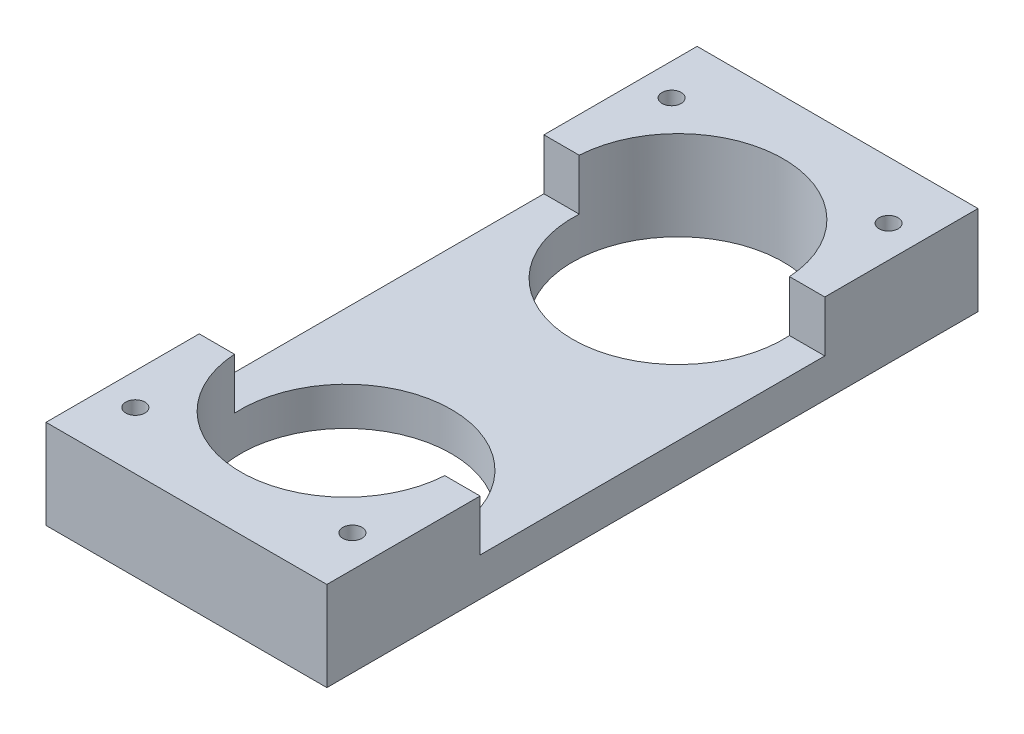
ISO-10303-21;
HEADER;
FILE_DESCRIPTION(('STEP AP214'),'2;1');
FILE_NAME('part.step','',(''),(''),'','','');
FILE_SCHEMA(('AUTOMOTIVE_DESIGN { 1 0 10303 214 1 1 1 1 }'));
ENDSEC;
DATA;
#1=APPLICATION_CONTEXT('core data for automotive mechanical design processes');
#2=APPLICATION_PROTOCOL_DEFINITION('international standard','automotive_design',2000,#1);
#3=PRODUCT_CONTEXT('',#1,'mechanical');
#4=PRODUCT('Part','Part','',(#3));
#5=PRODUCT_RELATED_PRODUCT_CATEGORY('part','',(#4));
#6=PRODUCT_DEFINITION_FORMATION('','',#4);
#7=PRODUCT_DEFINITION_CONTEXT('part definition',#1,'design');
#8=PRODUCT_DEFINITION('design','',#6,#7);
#9=PRODUCT_DEFINITION_SHAPE('','',#8);
#10=(LENGTH_UNIT() NAMED_UNIT(*) SI_UNIT(.MILLI.,.METRE.));
#11=(NAMED_UNIT(*) PLANE_ANGLE_UNIT() SI_UNIT($,.RADIAN.));
#12=(NAMED_UNIT(*) SI_UNIT($,.STERADIAN.) SOLID_ANGLE_UNIT());
#13=UNCERTAINTY_MEASURE_WITH_UNIT(LENGTH_MEASURE(1.E-05),#10,'distance_accuracy_value','');
#14=(GEOMETRIC_REPRESENTATION_CONTEXT(3) GLOBAL_UNCERTAINTY_ASSIGNED_CONTEXT((#13)) GLOBAL_UNIT_ASSIGNED_CONTEXT((#10,
#11,#12)) REPRESENTATION_CONTEXT('',''));
#15=CARTESIAN_POINT('',(0.,0.,0.));
#16=DIRECTION('',(0.,0.,1.));
#17=DIRECTION('',(1.,0.,0.));
#18=AXIS2_PLACEMENT_3D('',#15,#16,#17);
#19=CARTESIAN_POINT('',(0.,0.,0.));
#20=DIRECTION('',(0.,-1.,0.));
#21=DIRECTION('',(0.,0.,-1.));
#22=AXIS2_PLACEMENT_3D('',#19,#20,#21);
#23=PLANE('',#22);
#24=CARTESIAN_POINT('',(-8.5,0.,-21.));
#25=DIRECTION('',(0.,-1.,0.));
#26=DIRECTION('',(0.,0.,-1.));
#27=AXIS2_PLACEMENT_3D('',#24,#25,#26);
#28=CIRCLE('',#27,0.75);
#29=CARTESIAN_POINT('',(-8.5,0.,-21.75));
#30=VERTEX_POINT('',#29);
#31=EDGE_CURVE('E265',#30,#30,#28,.T.);
#32=ORIENTED_EDGE('',*,*,#31,.F.);
#33=EDGE_LOOP('',(#32));
#34=FACE_BOUND('',#33,.T.);
#35=CARTESIAN_POINT('',(8.5,0.,-21.));
#36=DIRECTION('',(0.,1.,0.));
#37=DIRECTION('',(0.,0.,1.));
#38=AXIS2_PLACEMENT_3D('',#35,#36,#37);
#39=CIRCLE('',#38,0.75);
#40=CARTESIAN_POINT('',(8.5,0.,-20.25));
#41=VERTEX_POINT('',#40);
#42=EDGE_CURVE('E259',#41,#41,#39,.T.);
#43=ORIENTED_EDGE('',*,*,#42,.T.);
#44=EDGE_LOOP('',(#43));
#45=FACE_BOUND('',#44,.T.);
#46=CARTESIAN_POINT('',(-8.5,0.,21.));
#47=DIRECTION('',(0.,1.,0.));
#48=DIRECTION('',(0.,0.,1.));
#49=AXIS2_PLACEMENT_3D('',#46,#47,#48);
#50=CIRCLE('',#49,0.75);
#51=CARTESIAN_POINT('',(-8.5,0.,21.75));
#52=VERTEX_POINT('',#51);
#53=EDGE_CURVE('E136',#52,#52,#50,.T.);
#54=ORIENTED_EDGE('',*,*,#53,.T.);
#55=EDGE_LOOP('',(#54));
#56=FACE_BOUND('',#55,.T.);
#57=CARTESIAN_POINT('',(0.,0.,-13.));
#58=DIRECTION('',(0.,1.,0.));
#59=DIRECTION('',(0.,0.,1.));
#60=AXIS2_PLACEMENT_3D('',#57,#58,#59);
#61=CIRCLE('',#60,8.25);
#62=CARTESIAN_POINT('',(0.,0.,-4.75));
#63=VERTEX_POINT('',#62);
#64=EDGE_CURVE('E135',#63,#63,#61,.T.);
#65=ORIENTED_EDGE('',*,*,#64,.T.);
#66=EDGE_LOOP('',(#65));
#67=FACE_BOUND('',#66,.T.);
#68=CARTESIAN_POINT('',(0.,0.,13.));
#69=DIRECTION('',(0.,-1.,0.));
#70=DIRECTION('',(0.,0.,-1.));
#71=AXIS2_PLACEMENT_3D('',#68,#69,#70);
#72=CIRCLE('',#71,8.25);
#73=CARTESIAN_POINT('',(0.,0.,4.75));
#74=VERTEX_POINT('',#73);
#75=EDGE_CURVE('E145',#74,#74,#72,.T.);
#76=ORIENTED_EDGE('',*,*,#75,.F.);
#77=EDGE_LOOP('',(#76));
#78=FACE_BOUND('',#77,.T.);
#79=DIRECTION('',(0.,0.,1.));
#80=VECTOR('',#79,1.);
#81=CARTESIAN_POINT('',(-11.,0.,-25.5));
#82=LINE('',#81,#80);
#83=CARTESIAN_POINT('',(-11.,0.,-25.5));
#84=VERTEX_POINT('',#83);
#85=CARTESIAN_POINT('',(-11.,0.,25.5));
#86=VERTEX_POINT('',#85);
#87=EDGE_CURVE('E196',#84,#86,#82,.T.);
#88=ORIENTED_EDGE('',*,*,#87,.F.);
#89=DIRECTION('',(-1.,0.,0.));
#90=VECTOR('',#89,1.);
#91=CARTESIAN_POINT('',(11.,0.,-25.5));
#92=LINE('',#91,#90);
#93=CARTESIAN_POINT('',(11.,0.,-25.5));
#94=VERTEX_POINT('',#93);
#95=EDGE_CURVE('E201',#94,#84,#92,.T.);
#96=ORIENTED_EDGE('',*,*,#95,.F.);
#97=DIRECTION('',(0.,0.,-1.));
#98=VECTOR('',#97,1.);
#99=CARTESIAN_POINT('',(11.,0.,-25.5));
#100=LINE('',#99,#98);
#101=CARTESIAN_POINT('',(11.,0.,25.5));
#102=VERTEX_POINT('',#101);
#103=EDGE_CURVE('E208',#102,#94,#100,.T.);
#104=ORIENTED_EDGE('',*,*,#103,.F.);
#105=DIRECTION('',(1.,0.,0.));
#106=VECTOR('',#105,1.);
#107=CARTESIAN_POINT('',(11.,0.,25.5));
#108=LINE('',#107,#106);
#109=EDGE_CURVE('E206',#86,#102,#108,.T.);
#110=ORIENTED_EDGE('',*,*,#109,.F.);
#111=EDGE_LOOP('',(#88,#96,#104,#110));
#112=FACE_BOUND('',#111,.T.);
#113=CARTESIAN_POINT('',(8.50000000000001,0.,21.));
#114=DIRECTION('',(0.,-1.,0.));
#115=DIRECTION('',(0.,0.,-1.));
#116=AXIS2_PLACEMENT_3D('',#113,#114,#115);
#117=CIRCLE('',#116,0.75);
#118=CARTESIAN_POINT('',(8.50000000000001,0.,20.25));
#119=VERTEX_POINT('',#118);
#120=EDGE_CURVE('E271',#119,#119,#117,.T.);
#121=ORIENTED_EDGE('',*,*,#120,.F.);
#122=EDGE_LOOP('',(#121));
#123=FACE_BOUND('',#122,.T.);
#124=ADVANCED_FACE('F39',(#34,#45,#56,#67,#78,#112,#123),#23,.T.);
#125=CARTESIAN_POINT('',(0.,7.,0.));
#126=DIRECTION('',(0.,1.,0.));
#127=DIRECTION('',(0.,0.,1.));
#128=AXIS2_PLACEMENT_3D('',#125,#126,#127);
#129=PLANE('',#128);
#130=DIRECTION('',(-1.,0.,0.));
#131=VECTOR('',#130,1.);
#132=CARTESIAN_POINT('',(0.,7.,-13.5));
#133=LINE('',#132,#131);
#134=CARTESIAN_POINT('',(-8.2348345460003,7.,-13.5));
#135=VERTEX_POINT('',#134);
#136=CARTESIAN_POINT('',(-11.,7.,-13.5));
#137=VERTEX_POINT('',#136);
#138=EDGE_CURVE('E142',#135,#137,#133,.T.);
#139=ORIENTED_EDGE('',*,*,#138,.F.);
#140=CARTESIAN_POINT('',(0.,7.,-13.));
#141=DIRECTION('',(0.,1.,0.));
#142=DIRECTION('',(0.,0.,1.));
#143=AXIS2_PLACEMENT_3D('',#140,#141,#142);
#144=CIRCLE('',#143,8.25);
#145=CARTESIAN_POINT('',(8.23483454600031,7.,-13.5));
#146=VERTEX_POINT('',#145);
#147=EDGE_CURVE('E125',#146,#135,#144,.T.);
#148=ORIENTED_EDGE('',*,*,#147,.F.);
#149=CARTESIAN_POINT('',(11.,7.,-13.5));
#150=VERTEX_POINT('',#149);
#151=EDGE_CURVE('E154',#150,#146,#133,.T.);
#152=ORIENTED_EDGE('',*,*,#151,.F.);
#153=DIRECTION('',(0.,0.,-1.));
#154=VECTOR('',#153,1.);
#155=CARTESIAN_POINT('',(11.,7.,0.));
#156=LINE('',#155,#154);
#157=CARTESIAN_POINT('',(11.,7.,-25.5));
#158=VERTEX_POINT('',#157);
#159=EDGE_CURVE('E157',#150,#158,#156,.T.);
#160=ORIENTED_EDGE('',*,*,#159,.T.);
#161=DIRECTION('',(-1.,0.,0.));
#162=VECTOR('',#161,1.);
#163=CARTESIAN_POINT('',(0.,7.,-25.5));
#164=LINE('',#163,#162);
#165=CARTESIAN_POINT('',(-11.,7.,-25.5));
#166=VERTEX_POINT('',#165);
#167=EDGE_CURVE('E165',#158,#166,#164,.T.);
#168=ORIENTED_EDGE('',*,*,#167,.T.);
#169=DIRECTION('',(0.,0.,1.));
#170=VECTOR('',#169,1.);
#171=CARTESIAN_POINT('',(-11.,7.,0.));
#172=LINE('',#171,#170);
#173=EDGE_CURVE('E152',#166,#137,#172,.T.);
#174=ORIENTED_EDGE('',*,*,#173,.T.);
#175=EDGE_LOOP('',(#139,#148,#152,#160,#168,#174));
#176=FACE_BOUND('',#175,.T.);
#177=CARTESIAN_POINT('',(8.5,7.,-21.));
#178=DIRECTION('',(0.,1.,0.));
#179=DIRECTION('',(0.,0.,1.));
#180=AXIS2_PLACEMENT_3D('',#177,#178,#179);
#181=CIRCLE('',#180,0.75);
#182=CARTESIAN_POINT('',(8.5,7.,-20.25));
#183=VERTEX_POINT('',#182);
#184=EDGE_CURVE('E262',#183,#183,#181,.T.);
#185=ORIENTED_EDGE('',*,*,#184,.F.);
#186=EDGE_LOOP('',(#185));
#187=FACE_BOUND('',#186,.T.);
#188=CARTESIAN_POINT('',(-8.5,7.,-21.));
#189=DIRECTION('',(0.,-1.,0.));
#190=DIRECTION('',(0.,0.,-1.));
#191=AXIS2_PLACEMENT_3D('',#188,#189,#190);
#192=CIRCLE('',#191,0.75);
#193=CARTESIAN_POINT('',(-8.5,7.,-21.75));
#194=VERTEX_POINT('',#193);
#195=EDGE_CURVE('E268',#194,#194,#192,.T.);
#196=ORIENTED_EDGE('',*,*,#195,.T.);
#197=EDGE_LOOP('',(#196));
#198=FACE_BOUND('',#197,.T.);
#199=ADVANCED_FACE('F148',(#176,#187,#198),#129,.T.);
#200=CARTESIAN_POINT('',(0.,7.,-13.5));
#201=DIRECTION('',(0.,0.,1.));
#202=DIRECTION('',(1.,0.,0.));
#203=AXIS2_PLACEMENT_3D('',#200,#201,#202);
#204=PLANE('',#203);
#205=DIRECTION('',(-1.,0.,0.));
#206=VECTOR('',#205,1.);
#207=CARTESIAN_POINT('',(0.,3.,-13.5));
#208=LINE('',#207,#206);
#209=CARTESIAN_POINT('',(-8.2348345460003,3.,-13.5));
#210=VERTEX_POINT('',#209);
#211=CARTESIAN_POINT('',(-11.,3.,-13.5));
#212=VERTEX_POINT('',#211);
#213=EDGE_CURVE('E144',#210,#212,#208,.T.);
#214=ORIENTED_EDGE('',*,*,#213,.F.);
#215=DIRECTION('',(0.,-1.,0.));
#216=VECTOR('',#215,1.);
#217=CARTESIAN_POINT('',(-8.2348345460003,7.,-13.5));
#218=LINE('',#217,#216);
#219=EDGE_CURVE('E129',#210,#135,#218,.F.);
#220=ORIENTED_EDGE('',*,*,#219,.T.);
#221=ORIENTED_EDGE('',*,*,#138,.T.);
#222=DIRECTION('',(0.,-1.,0.));
#223=VECTOR('',#222,1.);
#224=CARTESIAN_POINT('',(-11.,7.,-13.5));
#225=LINE('',#224,#223);
#226=EDGE_CURVE('E167',#137,#212,#225,.T.);
#227=ORIENTED_EDGE('',*,*,#226,.T.);
#228=EDGE_LOOP('',(#214,#220,#221,#227));
#229=FACE_BOUND('',#228,.T.);
#230=ADVANCED_FACE('F140',(#229),#204,.T.);
#231=ORIENTED_EDGE('',*,*,#151,.T.);
#232=DIRECTION('',(0.,-1.,0.));
#233=VECTOR('',#232,1.);
#234=CARTESIAN_POINT('',(8.23483454600031,7.,-13.5));
#235=LINE('',#234,#233);
#236=CARTESIAN_POINT('',(8.23483454600031,3.,-13.5));
#237=VERTEX_POINT('',#236);
#238=EDGE_CURVE('E54',#146,#237,#235,.T.);
#239=ORIENTED_EDGE('',*,*,#238,.T.);
#240=CARTESIAN_POINT('',(11.,3.,-13.5));
#241=VERTEX_POINT('',#240);
#242=EDGE_CURVE('E155',#241,#237,#208,.T.);
#243=ORIENTED_EDGE('',*,*,#242,.F.);
#244=DIRECTION('',(0.,-1.,0.));
#245=VECTOR('',#244,1.);
#246=CARTESIAN_POINT('',(11.,7.,-13.5));
#247=LINE('',#246,#245);
#248=EDGE_CURVE('E170',#150,#241,#247,.T.);
#249=ORIENTED_EDGE('',*,*,#248,.F.);
#250=EDGE_LOOP('',(#231,#239,#243,#249));
#251=FACE_BOUND('',#250,.T.);
#252=ADVANCED_FACE('F315',(#251),#204,.T.);
#253=CARTESIAN_POINT('',(0.,7.,13.5));
#254=DIRECTION('',(0.,0.,1.));
#255=DIRECTION('',(1.,0.,0.));
#256=AXIS2_PLACEMENT_3D('',#253,#254,#255);
#257=PLANE('',#256);
#258=DIRECTION('',(-1.,0.,0.));
#259=VECTOR('',#258,1.);
#260=CARTESIAN_POINT('',(0.,7.,13.5));
#261=LINE('',#260,#259);
#262=CARTESIAN_POINT('',(-8.2348345460003,7.,13.5));
#263=VERTEX_POINT('',#262);
#264=CARTESIAN_POINT('',(-11.,7.,13.5));
#265=VERTEX_POINT('',#264);
#266=EDGE_CURVE('E177',#263,#265,#261,.T.);
#267=ORIENTED_EDGE('',*,*,#266,.F.);
#268=DIRECTION('',(0.,-1.,0.));
#269=VECTOR('',#268,1.);
#270=CARTESIAN_POINT('',(-8.2348345460003,7.,13.5));
#271=LINE('',#270,#269);
#272=CARTESIAN_POINT('',(-8.2348345460003,3.,13.5));
#273=VERTEX_POINT('',#272);
#274=EDGE_CURVE('E62',#263,#273,#271,.T.);
#275=ORIENTED_EDGE('',*,*,#274,.T.);
#276=DIRECTION('',(-1.,0.,0.));
#277=VECTOR('',#276,1.);
#278=CARTESIAN_POINT('',(0.,3.,13.5));
#279=LINE('',#278,#277);
#280=CARTESIAN_POINT('',(-11.,3.,13.5));
#281=VERTEX_POINT('',#280);
#282=EDGE_CURVE('E173',#273,#281,#279,.T.);
#283=ORIENTED_EDGE('',*,*,#282,.T.);
#284=DIRECTION('',(0.,-1.,0.));
#285=VECTOR('',#284,1.);
#286=CARTESIAN_POINT('',(-11.,7.,13.5));
#287=LINE('',#286,#285);
#288=EDGE_CURVE('E188',#265,#281,#287,.T.);
#289=ORIENTED_EDGE('',*,*,#288,.F.);
#290=EDGE_LOOP('',(#267,#275,#283,#289));
#291=FACE_BOUND('',#290,.T.);
#292=ADVANCED_FACE('F313',(#291),#257,.F.);
#293=CARTESIAN_POINT('',(0.,3.,0.));
#294=DIRECTION('',(0.,-1.,0.));
#295=DIRECTION('',(0.,0.,-1.));
#296=AXIS2_PLACEMENT_3D('',#293,#294,#295);
#297=PLANE('',#296);
#298=CARTESIAN_POINT('',(0.,3.,-13.));
#299=DIRECTION('',(0.,-1.,0.));
#300=DIRECTION('',(0.,0.,-1.));
#301=AXIS2_PLACEMENT_3D('',#298,#299,#300);
#302=CIRCLE('',#301,8.25);
#303=EDGE_CURVE('E146',#210,#237,#302,.F.);
#304=ORIENTED_EDGE('',*,*,#303,.F.);
#305=ORIENTED_EDGE('',*,*,#213,.T.);
#306=DIRECTION('',(0.,0.,1.));
#307=VECTOR('',#306,1.);
#308=CARTESIAN_POINT('',(-11.,3.,-25.5));
#309=LINE('',#308,#307);
#310=EDGE_CURVE('E197',#212,#281,#309,.T.);
#311=ORIENTED_EDGE('',*,*,#310,.T.);
#312=ORIENTED_EDGE('',*,*,#282,.F.);
#313=CARTESIAN_POINT('',(0.,3.,13.));
#314=DIRECTION('',(0.,-1.,0.));
#315=DIRECTION('',(0.,0.,-1.));
#316=AXIS2_PLACEMENT_3D('',#313,#314,#315);
#317=CIRCLE('',#316,8.25);
#318=CARTESIAN_POINT('',(8.2348345460003,3.,13.5));
#319=VERTEX_POINT('',#318);
#320=EDGE_CURVE('E238',#273,#319,#317,.T.);
#321=ORIENTED_EDGE('',*,*,#320,.T.);
#322=CARTESIAN_POINT('',(11.,3.,13.5));
#323=VERTEX_POINT('',#322);
#324=EDGE_CURVE('E178',#323,#319,#279,.T.);
#325=ORIENTED_EDGE('',*,*,#324,.F.);
#326=DIRECTION('',(0.,0.,-1.));
#327=VECTOR('',#326,1.);
#328=CARTESIAN_POINT('',(11.,3.,-25.5));
#329=LINE('',#328,#327);
#330=EDGE_CURVE('E200',#323,#241,#329,.T.);
#331=ORIENTED_EDGE('',*,*,#330,.T.);
#332=ORIENTED_EDGE('',*,*,#242,.T.);
#333=EDGE_LOOP('',(#304,#305,#311,#312,#321,#325,#331,#332));
#334=FACE_BOUND('',#333,.T.);
#335=ADVANCED_FACE('F236',(#334),#297,.F.);
#336=CARTESIAN_POINT('',(-11.,3.,-25.5));
#337=DIRECTION('',(1.,0.,0.));
#338=DIRECTION('',(0.,0.,-1.));
#339=AXIS2_PLACEMENT_3D('',#336,#337,#338);
#340=PLANE('',#339);
#341=ORIENTED_EDGE('',*,*,#87,.T.);
#342=DIRECTION('',(0.,-1.,0.));
#343=VECTOR('',#342,1.);
#344=CARTESIAN_POINT('',(-11.,3.,25.5));
#345=LINE('',#344,#343);
#346=CARTESIAN_POINT('',(-11.,7.,25.5));
#347=VERTEX_POINT('',#346);
#348=EDGE_CURVE('E11',#347,#86,#345,.T.);
#349=ORIENTED_EDGE('',*,*,#348,.F.);
#350=DIRECTION('',(0.,0.,1.));
#351=VECTOR('',#350,1.);
#352=CARTESIAN_POINT('',(-11.,7.,0.));
#353=LINE('',#352,#351);
#354=EDGE_CURVE('E182',#265,#347,#353,.T.);
#355=ORIENTED_EDGE('',*,*,#354,.F.);
#356=ORIENTED_EDGE('',*,*,#288,.T.);
#357=ORIENTED_EDGE('',*,*,#310,.F.);
#358=ORIENTED_EDGE('',*,*,#226,.F.);
#359=ORIENTED_EDGE('',*,*,#173,.F.);
#360=DIRECTION('',(0.,-1.,0.));
#361=VECTOR('',#360,1.);
#362=CARTESIAN_POINT('',(-11.,3.,-25.5));
#363=LINE('',#362,#361);
#364=EDGE_CURVE('E203',#166,#84,#363,.T.);
#365=ORIENTED_EDGE('',*,*,#364,.T.);
#366=EDGE_LOOP('',(#341,#349,#355,#356,#357,#358,#359,#365));
#367=FACE_BOUND('',#366,.T.);
#368=ADVANCED_FACE('F41',(#367),#340,.F.);
#369=CARTESIAN_POINT('',(11.,3.,25.5));
#370=DIRECTION('',(0.,0.,-1.));
#371=DIRECTION('',(-1.,0.,0.));
#372=AXIS2_PLACEMENT_3D('',#369,#370,#371);
#373=PLANE('',#372);
#374=ORIENTED_EDGE('',*,*,#109,.T.);
#375=DIRECTION('',(0.,-1.,0.));
#376=VECTOR('',#375,1.);
#377=CARTESIAN_POINT('',(11.,3.,25.5));
#378=LINE('',#377,#376);
#379=CARTESIAN_POINT('',(11.,7.,25.5));
#380=VERTEX_POINT('',#379);
#381=EDGE_CURVE('E47',#380,#102,#378,.T.);
#382=ORIENTED_EDGE('',*,*,#381,.F.);
#383=DIRECTION('',(1.,0.,0.));
#384=VECTOR('',#383,1.);
#385=CARTESIAN_POINT('',(0.,7.,25.5));
#386=LINE('',#385,#384);
#387=EDGE_CURVE('E185',#347,#380,#386,.T.);
#388=ORIENTED_EDGE('',*,*,#387,.F.);
#389=ORIENTED_EDGE('',*,*,#348,.T.);
#390=EDGE_LOOP('',(#374,#382,#388,#389));
#391=FACE_BOUND('',#390,.T.);
#392=ADVANCED_FACE('F307',(#391),#373,.F.);
#393=CARTESIAN_POINT('',(11.,3.,-25.5));
#394=DIRECTION('',(-1.,0.,0.));
#395=DIRECTION('',(0.,0.,1.));
#396=AXIS2_PLACEMENT_3D('',#393,#394,#395);
#397=PLANE('',#396);
#398=ORIENTED_EDGE('',*,*,#103,.T.);
#399=DIRECTION('',(0.,-1.,0.));
#400=VECTOR('',#399,1.);
#401=CARTESIAN_POINT('',(11.,3.,-25.5));
#402=LINE('',#401,#400);
#403=EDGE_CURVE('E213',#158,#94,#402,.T.);
#404=ORIENTED_EDGE('',*,*,#403,.F.);
#405=ORIENTED_EDGE('',*,*,#159,.F.);
#406=ORIENTED_EDGE('',*,*,#248,.T.);
#407=ORIENTED_EDGE('',*,*,#330,.F.);
#408=DIRECTION('',(0.,-1.,0.));
#409=VECTOR('',#408,1.);
#410=CARTESIAN_POINT('',(11.,7.,13.5));
#411=LINE('',#410,#409);
#412=CARTESIAN_POINT('',(11.,7.,13.5));
#413=VERTEX_POINT('',#412);
#414=EDGE_CURVE('E193',#413,#323,#411,.T.);
#415=ORIENTED_EDGE('',*,*,#414,.F.);
#416=DIRECTION('',(0.,0.,-1.));
#417=VECTOR('',#416,1.);
#418=CARTESIAN_POINT('',(11.,7.,0.));
#419=LINE('',#418,#417);
#420=EDGE_CURVE('E174',#380,#413,#419,.T.);
#421=ORIENTED_EDGE('',*,*,#420,.F.);
#422=ORIENTED_EDGE('',*,*,#381,.T.);
#423=EDGE_LOOP('',(#398,#404,#405,#406,#407,#415,#421,#422));
#424=FACE_BOUND('',#423,.T.);
#425=ADVANCED_FACE('F219',(#424),#397,.F.);
#426=CARTESIAN_POINT('',(11.,3.,-25.5));
#427=DIRECTION('',(0.,0.,1.));
#428=DIRECTION('',(1.,0.,0.));
#429=AXIS2_PLACEMENT_3D('',#426,#427,#428);
#430=PLANE('',#429);
#431=ORIENTED_EDGE('',*,*,#95,.T.);
#432=ORIENTED_EDGE('',*,*,#364,.F.);
#433=ORIENTED_EDGE('',*,*,#167,.F.);
#434=ORIENTED_EDGE('',*,*,#403,.T.);
#435=EDGE_LOOP('',(#431,#432,#433,#434));
#436=FACE_BOUND('',#435,.T.);
#437=ADVANCED_FACE('F228',(#436),#430,.F.);
#438=ORIENTED_EDGE('',*,*,#324,.T.);
#439=DIRECTION('',(0.,-1.,0.));
#440=VECTOR('',#439,1.);
#441=CARTESIAN_POINT('',(8.2348345460003,7.,13.5));
#442=LINE('',#441,#440);
#443=CARTESIAN_POINT('',(8.2348345460003,7.,13.5));
#444=VERTEX_POINT('',#443);
#445=EDGE_CURVE('E241',#319,#444,#442,.F.);
#446=ORIENTED_EDGE('',*,*,#445,.T.);
#447=EDGE_CURVE('E179',#413,#444,#261,.T.);
#448=ORIENTED_EDGE('',*,*,#447,.F.);
#449=ORIENTED_EDGE('',*,*,#414,.T.);
#450=EDGE_LOOP('',(#438,#446,#448,#449));
#451=FACE_BOUND('',#450,.T.);
#452=ADVANCED_FACE('F305',(#451),#257,.F.);
#453=CARTESIAN_POINT('',(0.,7.,0.));
#454=DIRECTION('',(0.,1.,0.));
#455=DIRECTION('',(0.,0.,1.));
#456=AXIS2_PLACEMENT_3D('',#453,#454,#455);
#457=PLANE('',#456);
#458=CARTESIAN_POINT('',(8.50000000000001,7.,21.));
#459=DIRECTION('',(0.,-1.,0.));
#460=DIRECTION('',(0.,0.,-1.));
#461=AXIS2_PLACEMENT_3D('',#458,#459,#460);
#462=CIRCLE('',#461,0.75);
#463=CARTESIAN_POINT('',(8.50000000000001,7.,20.25));
#464=VERTEX_POINT('',#463);
#465=EDGE_CURVE('E256',#464,#464,#462,.T.);
#466=ORIENTED_EDGE('',*,*,#465,.T.);
#467=EDGE_LOOP('',(#466));
#468=FACE_BOUND('',#467,.T.);
#469=CARTESIAN_POINT('',(-8.5,7.,21.));
#470=DIRECTION('',(0.,1.,0.));
#471=DIRECTION('',(0.,0.,1.));
#472=AXIS2_PLACEMENT_3D('',#469,#470,#471);
#473=CIRCLE('',#472,0.75);
#474=CARTESIAN_POINT('',(-8.5,7.,21.75));
#475=VERTEX_POINT('',#474);
#476=EDGE_CURVE('E253',#475,#475,#473,.T.);
#477=ORIENTED_EDGE('',*,*,#476,.F.);
#478=EDGE_LOOP('',(#477));
#479=FACE_BOUND('',#478,.T.);
#480=CARTESIAN_POINT('',(0.,7.,13.));
#481=DIRECTION('',(0.,-1.,0.));
#482=DIRECTION('',(0.,0.,-1.));
#483=AXIS2_PLACEMENT_3D('',#480,#481,#482);
#484=CIRCLE('',#483,8.25);
#485=EDGE_CURVE('E243',#444,#263,#484,.T.);
#486=ORIENTED_EDGE('',*,*,#485,.T.);
#487=ORIENTED_EDGE('',*,*,#266,.T.);
#488=ORIENTED_EDGE('',*,*,#354,.T.);
#489=ORIENTED_EDGE('',*,*,#387,.T.);
#490=ORIENTED_EDGE('',*,*,#420,.T.);
#491=ORIENTED_EDGE('',*,*,#447,.T.);
#492=EDGE_LOOP('',(#486,#487,#488,#489,#490,#491));
#493=FACE_BOUND('',#492,.T.);
#494=ADVANCED_FACE('F277',(#468,#479,#493),#457,.T.);
#495=CARTESIAN_POINT('',(0.,7.,13.));
#496=DIRECTION('',(0.,-1.,0.));
#497=DIRECTION('',(0.,0.,-1.));
#498=AXIS2_PLACEMENT_3D('',#495,#496,#497);
#499=CYLINDRICAL_SURFACE('',#498,8.25);
#500=ORIENTED_EDGE('',*,*,#75,.T.);
#501=EDGE_LOOP('',(#500));
#502=FACE_BOUND('',#501,.T.);
#503=ORIENTED_EDGE('',*,*,#485,.F.);
#504=ORIENTED_EDGE('',*,*,#445,.F.);
#505=ORIENTED_EDGE('',*,*,#320,.F.);
#506=ORIENTED_EDGE('',*,*,#274,.F.);
#507=EDGE_LOOP('',(#503,#504,#505,#506));
#508=FACE_BOUND('',#507,.T.);
#509=ADVANCED_FACE('F328',(#502,#508),#499,.F.);
#510=CARTESIAN_POINT('',(0.,7.,-13.));
#511=DIRECTION('',(0.,-1.,0.));
#512=DIRECTION('',(0.,0.,-1.));
#513=AXIS2_PLACEMENT_3D('',#510,#511,#512);
#514=CYLINDRICAL_SURFACE('',#513,8.25);
#515=ORIENTED_EDGE('',*,*,#303,.T.);
#516=ORIENTED_EDGE('',*,*,#238,.F.);
#517=ORIENTED_EDGE('',*,*,#147,.T.);
#518=ORIENTED_EDGE('',*,*,#219,.F.);
#519=EDGE_LOOP('',(#515,#516,#517,#518));
#520=FACE_BOUND('',#519,.T.);
#521=ORIENTED_EDGE('',*,*,#64,.F.);
#522=EDGE_LOOP('',(#521));
#523=FACE_BOUND('',#522,.T.);
#524=ADVANCED_FACE('F127',(#520,#523),#514,.F.);
#525=CARTESIAN_POINT('',(-8.5,0.,21.));
#526=DIRECTION('',(0.,1.,0.));
#527=DIRECTION('',(0.,0.,1.));
#528=AXIS2_PLACEMENT_3D('',#525,#526,#527);
#529=CYLINDRICAL_SURFACE('',#528,0.75);
#530=ORIENTED_EDGE('',*,*,#53,.F.);
#531=EDGE_LOOP('',(#530));
#532=FACE_BOUND('',#531,.T.);
#533=ORIENTED_EDGE('',*,*,#476,.T.);
#534=EDGE_LOOP('',(#533));
#535=FACE_BOUND('',#534,.T.);
#536=ADVANCED_FACE('F338',(#532,#535),#529,.F.);
#537=CARTESIAN_POINT('',(8.5,0.,-21.));
#538=DIRECTION('',(0.,1.,0.));
#539=DIRECTION('',(0.,0.,1.));
#540=AXIS2_PLACEMENT_3D('',#537,#538,#539);
#541=CYLINDRICAL_SURFACE('',#540,0.75);
#542=ORIENTED_EDGE('',*,*,#42,.F.);
#543=EDGE_LOOP('',(#542));
#544=FACE_BOUND('',#543,.T.);
#545=ORIENTED_EDGE('',*,*,#184,.T.);
#546=EDGE_LOOP('',(#545));
#547=FACE_BOUND('',#546,.T.);
#548=ADVANCED_FACE('F288',(#544,#547),#541,.F.);
#549=CARTESIAN_POINT('',(-8.5,0.,-21.));
#550=DIRECTION('',(0.,1.,0.));
#551=DIRECTION('',(0.,0.,1.));
#552=AXIS2_PLACEMENT_3D('',#549,#550,#551);
#553=CYLINDRICAL_SURFACE('',#552,0.75);
#554=ORIENTED_EDGE('',*,*,#31,.T.);
#555=EDGE_LOOP('',(#554));
#556=FACE_BOUND('',#555,.T.);
#557=ORIENTED_EDGE('',*,*,#195,.F.);
#558=EDGE_LOOP('',(#557));
#559=FACE_BOUND('',#558,.T.);
#560=ADVANCED_FACE('F282',(#556,#559),#553,.F.);
#561=CARTESIAN_POINT('',(8.50000000000001,0.,21.));
#562=DIRECTION('',(0.,1.,0.));
#563=DIRECTION('',(0.,0.,1.));
#564=AXIS2_PLACEMENT_3D('',#561,#562,#563);
#565=CYLINDRICAL_SURFACE('',#564,0.75);
#566=ORIENTED_EDGE('',*,*,#120,.T.);
#567=EDGE_LOOP('',(#566));
#568=FACE_BOUND('',#567,.T.);
#569=ORIENTED_EDGE('',*,*,#465,.F.);
#570=EDGE_LOOP('',(#569));
#571=FACE_BOUND('',#570,.T.);
#572=ADVANCED_FACE('F280',(#568,#571),#565,.F.);
#573=CLOSED_SHELL('',(#124,#199,#230,#252,#292,#335,#368,#392,#425,#437,#452,#494,#509,#524,
#536,#548,#560,#572));
#574=MANIFOLD_SOLID_BREP('B2',#573);
#575=ADVANCED_BREP_SHAPE_REPRESENTATION('',(#18,#574),#14);
#576=SHAPE_DEFINITION_REPRESENTATION(#9,#575);
ENDSEC;
END-ISO-10303-21;
